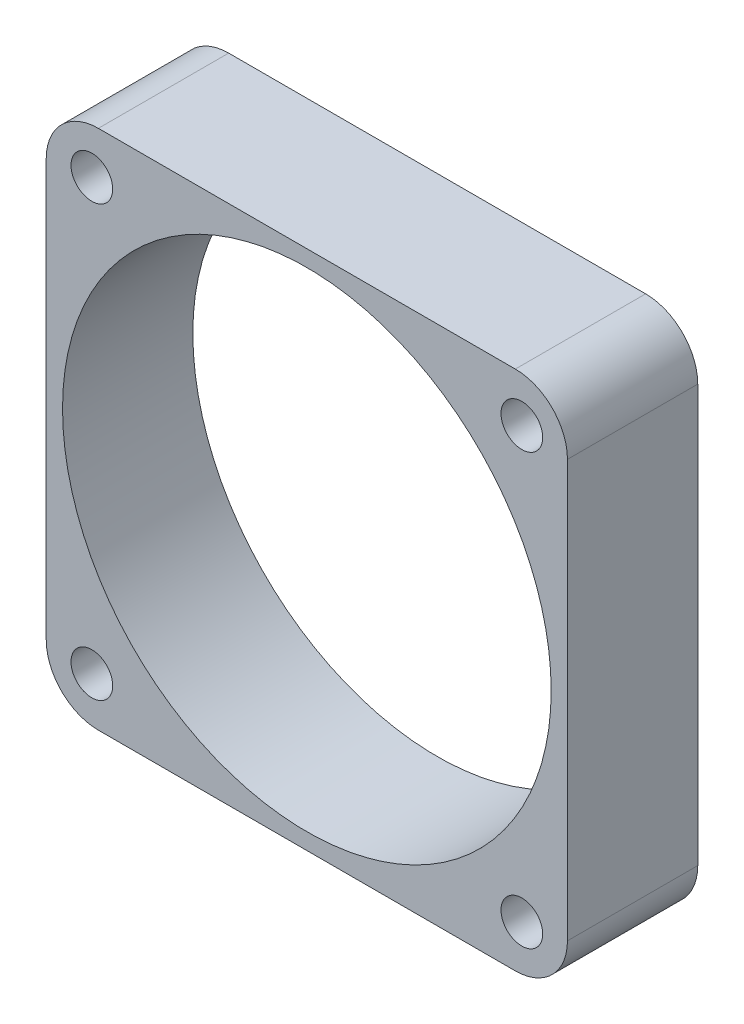
ISO-10303-21;
HEADER;
FILE_DESCRIPTION(('STEP AP214'),'2;1');
FILE_NAME('part.step','',(''),(''),'','','');
FILE_SCHEMA(('AUTOMOTIVE_DESIGN { 1 0 10303 214 1 1 1 1 }'));
ENDSEC;
DATA;
#1=APPLICATION_CONTEXT('core data for automotive mechanical design processes');
#2=APPLICATION_PROTOCOL_DEFINITION('international standard','automotive_design',2000,#1);
#3=PRODUCT_CONTEXT('',#1,'mechanical');
#4=PRODUCT('Part','Part','',(#3));
#5=PRODUCT_RELATED_PRODUCT_CATEGORY('part','',(#4));
#6=PRODUCT_DEFINITION_FORMATION('','',#4);
#7=PRODUCT_DEFINITION_CONTEXT('part definition',#1,'design');
#8=PRODUCT_DEFINITION('design','',#6,#7);
#9=PRODUCT_DEFINITION_SHAPE('','',#8);
#10=(LENGTH_UNIT() NAMED_UNIT(*) SI_UNIT(.MILLI.,.METRE.));
#11=(NAMED_UNIT(*) PLANE_ANGLE_UNIT() SI_UNIT($,.RADIAN.));
#12=(NAMED_UNIT(*) SI_UNIT($,.STERADIAN.) SOLID_ANGLE_UNIT());
#13=UNCERTAINTY_MEASURE_WITH_UNIT(LENGTH_MEASURE(1.E-05),#10,'distance_accuracy_value','');
#14=(GEOMETRIC_REPRESENTATION_CONTEXT(3) GLOBAL_UNCERTAINTY_ASSIGNED_CONTEXT((#13)) GLOBAL_UNIT_ASSIGNED_CONTEXT((#10,
#11,#12)) REPRESENTATION_CONTEXT('',''));
#15=CARTESIAN_POINT('',(0.,0.,0.));
#16=DIRECTION('',(0.,0.,1.));
#17=DIRECTION('',(1.,0.,0.));
#18=AXIS2_PLACEMENT_3D('',#15,#16,#17);
#19=CARTESIAN_POINT('',(4.,4.,10.));
#20=DIRECTION('',(0.,0.,1.));
#21=DIRECTION('',(1.,0.,0.));
#22=AXIS2_PLACEMENT_3D('',#19,#20,#21);
#23=PLANE('',#22);
#24=CARTESIAN_POINT('',(3.5,3.5,10.));
#25=DIRECTION('',(0.,0.,1.));
#26=DIRECTION('',(1.,0.,0.));
#27=AXIS2_PLACEMENT_3D('',#24,#25,#26);
#28=CIRCLE('',#27,1.6);
#29=CARTESIAN_POINT('',(5.1,3.5,10.));
#30=VERTEX_POINT('',#29);
#31=EDGE_CURVE('E197',#30,#30,#28,.T.);
#32=ORIENTED_EDGE('',*,*,#31,.F.);
#33=EDGE_LOOP('',(#32));
#34=FACE_BOUND('',#33,.T.);
#35=CARTESIAN_POINT('',(36.5,36.5,10.));
#36=DIRECTION('',(0.,0.,1.));
#37=DIRECTION('',(1.,0.,0.));
#38=AXIS2_PLACEMENT_3D('',#35,#36,#37);
#39=CIRCLE('',#38,1.6);
#40=CARTESIAN_POINT('',(38.1,36.5,10.));
#41=VERTEX_POINT('',#40);
#42=EDGE_CURVE('E185',#41,#41,#39,.T.);
#43=ORIENTED_EDGE('',*,*,#42,.F.);
#44=EDGE_LOOP('',(#43));
#45=FACE_BOUND('',#44,.T.);
#46=CARTESIAN_POINT('',(4.,4.,10.));
#47=DIRECTION('',(0.,0.,1.));
#48=DIRECTION('',(1.,0.,0.));
#49=AXIS2_PLACEMENT_3D('',#46,#47,#48);
#50=CIRCLE('',#49,4.);
#51=CARTESIAN_POINT('',(0.,4.00000000000003,10.));
#52=VERTEX_POINT('',#51);
#53=CARTESIAN_POINT('',(4.00000000000003,0.,10.));
#54=VERTEX_POINT('',#53);
#55=EDGE_CURVE('E148',#52,#54,#50,.T.);
#56=ORIENTED_EDGE('',*,*,#55,.T.);
#57=DIRECTION('',(1.,0.,0.));
#58=VECTOR('',#57,1.);
#59=CARTESIAN_POINT('',(4.00000000000003,0.,10.));
#60=LINE('',#59,#58);
#61=CARTESIAN_POINT('',(36.,0.,10.));
#62=VERTEX_POINT('',#61);
#63=EDGE_CURVE('E96',#54,#62,#60,.T.);
#64=ORIENTED_EDGE('',*,*,#63,.T.);
#65=CARTESIAN_POINT('',(36.,4.,10.));
#66=DIRECTION('',(0.,0.,1.));
#67=DIRECTION('',(1.,0.,0.));
#68=AXIS2_PLACEMENT_3D('',#65,#66,#67);
#69=CIRCLE('',#68,4.);
#70=CARTESIAN_POINT('',(40.,4.00000000000003,10.));
#71=VERTEX_POINT('',#70);
#72=EDGE_CURVE('E163',#62,#71,#69,.T.);
#73=ORIENTED_EDGE('',*,*,#72,.T.);
#74=DIRECTION('',(0.,1.,0.));
#75=VECTOR('',#74,1.);
#76=CARTESIAN_POINT('',(40.,4.00000000000003,10.));
#77=LINE('',#76,#75);
#78=CARTESIAN_POINT('',(40.,36.,10.));
#79=VERTEX_POINT('',#78);
#80=EDGE_CURVE('E176',#71,#79,#77,.T.);
#81=ORIENTED_EDGE('',*,*,#80,.T.);
#82=CARTESIAN_POINT('',(36.,36.,10.));
#83=DIRECTION('',(0.,0.,1.));
#84=DIRECTION('',(1.,0.,0.));
#85=AXIS2_PLACEMENT_3D('',#82,#83,#84);
#86=CIRCLE('',#85,4.);
#87=CARTESIAN_POINT('',(36.,40.,10.));
#88=VERTEX_POINT('',#87);
#89=EDGE_CURVE('E115',#79,#88,#86,.T.);
#90=ORIENTED_EDGE('',*,*,#89,.T.);
#91=DIRECTION('',(-1.,0.,0.));
#92=VECTOR('',#91,1.);
#93=CARTESIAN_POINT('',(4.00000000000003,40.,10.));
#94=LINE('',#93,#92);
#95=CARTESIAN_POINT('',(4.00000000000003,40.,10.));
#96=VERTEX_POINT('',#95);
#97=EDGE_CURVE('E109',#88,#96,#94,.T.);
#98=ORIENTED_EDGE('',*,*,#97,.T.);
#99=CARTESIAN_POINT('',(4.,36.,10.));
#100=DIRECTION('',(0.,0.,1.));
#101=DIRECTION('',(1.,0.,0.));
#102=AXIS2_PLACEMENT_3D('',#99,#100,#101);
#103=CIRCLE('',#102,4.);
#104=CARTESIAN_POINT('',(0.,36.,10.));
#105=VERTEX_POINT('',#104);
#106=EDGE_CURVE('E113',#96,#105,#103,.T.);
#107=ORIENTED_EDGE('',*,*,#106,.T.);
#108=DIRECTION('',(0.,-1.,0.));
#109=VECTOR('',#108,1.);
#110=CARTESIAN_POINT('',(0.,4.00000000000003,10.));
#111=LINE('',#110,#109);
#112=EDGE_CURVE('E53',#105,#52,#111,.T.);
#113=ORIENTED_EDGE('',*,*,#112,.T.);
#114=EDGE_LOOP('',(#56,#64,#73,#81,#90,#98,#107,#113));
#115=FACE_BOUND('',#114,.T.);
#116=CARTESIAN_POINT('',(3.49999999999999,36.5,10.));
#117=DIRECTION('',(0.,0.,1.));
#118=DIRECTION('',(1.,0.,0.));
#119=AXIS2_PLACEMENT_3D('',#116,#117,#118);
#120=CIRCLE('',#119,1.6);
#121=CARTESIAN_POINT('',(5.09999999999999,36.5,10.));
#122=VERTEX_POINT('',#121);
#123=EDGE_CURVE('E137',#122,#122,#120,.T.);
#124=ORIENTED_EDGE('',*,*,#123,.F.);
#125=EDGE_LOOP('',(#124));
#126=FACE_BOUND('',#125,.T.);
#127=CARTESIAN_POINT('',(36.5,3.5,10.));
#128=DIRECTION('',(0.,0.,1.));
#129=DIRECTION('',(1.,0.,0.));
#130=AXIS2_PLACEMENT_3D('',#127,#128,#129);
#131=CIRCLE('',#130,1.6);
#132=CARTESIAN_POINT('',(38.1,3.5,10.));
#133=VERTEX_POINT('',#132);
#134=EDGE_CURVE('E191',#133,#133,#131,.T.);
#135=ORIENTED_EDGE('',*,*,#134,.F.);
#136=EDGE_LOOP('',(#135));
#137=FACE_BOUND('',#136,.T.);
#138=CARTESIAN_POINT('',(20.,20.,10.));
#139=DIRECTION('',(0.,0.,1.));
#140=DIRECTION('',(1.,0.,0.));
#141=AXIS2_PLACEMENT_3D('',#138,#139,#140);
#142=CIRCLE('',#141,18.75);
#143=CARTESIAN_POINT('',(38.75,20.,10.));
#144=VERTEX_POINT('',#143);
#145=EDGE_CURVE('E203',#144,#144,#142,.T.);
#146=ORIENTED_EDGE('',*,*,#145,.F.);
#147=EDGE_LOOP('',(#146));
#148=FACE_BOUND('',#147,.T.);
#149=ADVANCED_FACE('F36',(#34,#45,#115,#126,#137,#148),#23,.T.);
#150=CARTESIAN_POINT('',(4.,4.,0.));
#151=DIRECTION('',(0.,0.,1.));
#152=DIRECTION('',(1.,0.,0.));
#153=AXIS2_PLACEMENT_3D('',#150,#151,#152);
#154=PLANE('',#153);
#155=CARTESIAN_POINT('',(4.,4.,0.));
#156=DIRECTION('',(0.,0.,1.));
#157=DIRECTION('',(1.,0.,0.));
#158=AXIS2_PLACEMENT_3D('',#155,#156,#157);
#159=CIRCLE('',#158,4.);
#160=CARTESIAN_POINT('',(0.,4.00000000000003,0.));
#161=VERTEX_POINT('',#160);
#162=CARTESIAN_POINT('',(4.00000000000003,0.,0.));
#163=VERTEX_POINT('',#162);
#164=EDGE_CURVE('E133',#161,#163,#159,.T.);
#165=ORIENTED_EDGE('',*,*,#164,.F.);
#166=DIRECTION('',(0.,-1.,0.));
#167=VECTOR('',#166,1.);
#168=CARTESIAN_POINT('',(0.,4.00000000000003,0.));
#169=LINE('',#168,#167);
#170=CARTESIAN_POINT('',(0.,36.,0.));
#171=VERTEX_POINT('',#170);
#172=EDGE_CURVE('E88',#171,#161,#169,.T.);
#173=ORIENTED_EDGE('',*,*,#172,.F.);
#174=CARTESIAN_POINT('',(4.,36.,0.));
#175=DIRECTION('',(0.,0.,1.));
#176=DIRECTION('',(1.,0.,0.));
#177=AXIS2_PLACEMENT_3D('',#174,#175,#176);
#178=CIRCLE('',#177,4.);
#179=CARTESIAN_POINT('',(4.00000000000003,40.,0.));
#180=VERTEX_POINT('',#179);
#181=EDGE_CURVE('E82',#180,#171,#178,.T.);
#182=ORIENTED_EDGE('',*,*,#181,.F.);
#183=DIRECTION('',(-1.,0.,0.));
#184=VECTOR('',#183,1.);
#185=CARTESIAN_POINT('',(4.00000000000003,40.,0.));
#186=LINE('',#185,#184);
#187=CARTESIAN_POINT('',(36.,40.,0.));
#188=VERTEX_POINT('',#187);
#189=EDGE_CURVE('E123',#188,#180,#186,.T.);
#190=ORIENTED_EDGE('',*,*,#189,.F.);
#191=CARTESIAN_POINT('',(36.,36.,0.));
#192=DIRECTION('',(0.,0.,1.));
#193=DIRECTION('',(1.,0.,0.));
#194=AXIS2_PLACEMENT_3D('',#191,#192,#193);
#195=CIRCLE('',#194,4.);
#196=CARTESIAN_POINT('',(40.,36.,0.));
#197=VERTEX_POINT('',#196);
#198=EDGE_CURVE('E143',#197,#188,#195,.T.);
#199=ORIENTED_EDGE('',*,*,#198,.F.);
#200=DIRECTION('',(0.,1.,0.));
#201=VECTOR('',#200,1.);
#202=CARTESIAN_POINT('',(40.,4.00000000000003,0.));
#203=LINE('',#202,#201);
#204=CARTESIAN_POINT('',(40.,4.00000000000003,0.));
#205=VERTEX_POINT('',#204);
#206=EDGE_CURVE('E141',#205,#197,#203,.T.);
#207=ORIENTED_EDGE('',*,*,#206,.F.);
#208=CARTESIAN_POINT('',(36.,4.,0.));
#209=DIRECTION('',(0.,0.,1.));
#210=DIRECTION('',(1.,0.,0.));
#211=AXIS2_PLACEMENT_3D('',#208,#209,#210);
#212=CIRCLE('',#211,4.);
#213=CARTESIAN_POINT('',(36.,0.,0.));
#214=VERTEX_POINT('',#213);
#215=EDGE_CURVE('E139',#214,#205,#212,.T.);
#216=ORIENTED_EDGE('',*,*,#215,.F.);
#217=DIRECTION('',(1.,0.,0.));
#218=VECTOR('',#217,1.);
#219=CARTESIAN_POINT('',(4.00000000000003,0.,0.));
#220=LINE('',#219,#218);
#221=EDGE_CURVE('E136',#163,#214,#220,.T.);
#222=ORIENTED_EDGE('',*,*,#221,.F.);
#223=EDGE_LOOP('',(#165,#173,#182,#190,#199,#207,#216,#222));
#224=FACE_BOUND('',#223,.T.);
#225=CARTESIAN_POINT('',(3.49999999999999,36.5,0.));
#226=DIRECTION('',(0.,0.,1.));
#227=DIRECTION('',(1.,0.,0.));
#228=AXIS2_PLACEMENT_3D('',#225,#226,#227);
#229=CIRCLE('',#228,1.6);
#230=CARTESIAN_POINT('',(5.09999999999999,36.5,0.));
#231=VERTEX_POINT('',#230);
#232=EDGE_CURVE('E182',#231,#231,#229,.T.);
#233=ORIENTED_EDGE('',*,*,#232,.T.);
#234=EDGE_LOOP('',(#233));
#235=FACE_BOUND('',#234,.T.);
#236=CARTESIAN_POINT('',(36.5,36.5,0.));
#237=DIRECTION('',(0.,0.,1.));
#238=DIRECTION('',(1.,0.,0.));
#239=AXIS2_PLACEMENT_3D('',#236,#237,#238);
#240=CIRCLE('',#239,1.6);
#241=CARTESIAN_POINT('',(38.1,36.5,0.));
#242=VERTEX_POINT('',#241);
#243=EDGE_CURVE('E188',#242,#242,#240,.T.);
#244=ORIENTED_EDGE('',*,*,#243,.T.);
#245=EDGE_LOOP('',(#244));
#246=FACE_BOUND('',#245,.T.);
#247=CARTESIAN_POINT('',(36.5,3.5,0.));
#248=DIRECTION('',(0.,0.,1.));
#249=DIRECTION('',(1.,0.,0.));
#250=AXIS2_PLACEMENT_3D('',#247,#248,#249);
#251=CIRCLE('',#250,1.6);
#252=CARTESIAN_POINT('',(38.1,3.5,0.));
#253=VERTEX_POINT('',#252);
#254=EDGE_CURVE('E194',#253,#253,#251,.T.);
#255=ORIENTED_EDGE('',*,*,#254,.T.);
#256=EDGE_LOOP('',(#255));
#257=FACE_BOUND('',#256,.T.);
#258=CARTESIAN_POINT('',(3.5,3.5,0.));
#259=DIRECTION('',(0.,0.,1.));
#260=DIRECTION('',(1.,0.,0.));
#261=AXIS2_PLACEMENT_3D('',#258,#259,#260);
#262=CIRCLE('',#261,1.6);
#263=CARTESIAN_POINT('',(5.1,3.5,0.));
#264=VERTEX_POINT('',#263);
#265=EDGE_CURVE('E200',#264,#264,#262,.T.);
#266=ORIENTED_EDGE('',*,*,#265,.T.);
#267=EDGE_LOOP('',(#266));
#268=FACE_BOUND('',#267,.T.);
#269=CARTESIAN_POINT('',(20.,20.,0.));
#270=DIRECTION('',(0.,0.,1.));
#271=DIRECTION('',(1.,0.,0.));
#272=AXIS2_PLACEMENT_3D('',#269,#270,#271);
#273=CIRCLE('',#272,18.75);
#274=CARTESIAN_POINT('',(38.75,20.,0.));
#275=VERTEX_POINT('',#274);
#276=EDGE_CURVE('E206',#275,#275,#273,.T.);
#277=ORIENTED_EDGE('',*,*,#276,.T.);
#278=EDGE_LOOP('',(#277));
#279=FACE_BOUND('',#278,.T.);
#280=ADVANCED_FACE('F167',(#224,#235,#246,#257,#268,#279),#154,.F.);
#281=CARTESIAN_POINT('',(4.,4.,10.));
#282=DIRECTION('',(0.,0.,-1.));
#283=DIRECTION('',(-1.,0.,0.));
#284=AXIS2_PLACEMENT_3D('',#281,#282,#283);
#285=CYLINDRICAL_SURFACE('',#284,4.);
#286=ORIENTED_EDGE('',*,*,#164,.T.);
#287=DIRECTION('',(0.,0.,-1.));
#288=VECTOR('',#287,1.);
#289=CARTESIAN_POINT('',(4.00000000000003,0.,10.));
#290=LINE('',#289,#288);
#291=EDGE_CURVE('E11',#54,#163,#290,.T.);
#292=ORIENTED_EDGE('',*,*,#291,.F.);
#293=ORIENTED_EDGE('',*,*,#55,.F.);
#294=DIRECTION('',(0.,0.,-1.));
#295=VECTOR('',#294,1.);
#296=CARTESIAN_POINT('',(0.,4.00000000000003,10.));
#297=LINE('',#296,#295);
#298=EDGE_CURVE('E129',#52,#161,#297,.T.);
#299=ORIENTED_EDGE('',*,*,#298,.T.);
#300=EDGE_LOOP('',(#286,#292,#293,#299));
#301=FACE_BOUND('',#300,.T.);
#302=ADVANCED_FACE('F38',(#301),#285,.T.);
#303=CARTESIAN_POINT('',(4.00000000000003,0.,10.));
#304=DIRECTION('',(0.,1.,0.));
#305=DIRECTION('',(0.,0.,1.));
#306=AXIS2_PLACEMENT_3D('',#303,#304,#305);
#307=PLANE('',#306);
#308=ORIENTED_EDGE('',*,*,#221,.T.);
#309=DIRECTION('',(0.,0.,-1.));
#310=VECTOR('',#309,1.);
#311=CARTESIAN_POINT('',(36.,0.,10.));
#312=LINE('',#311,#310);
#313=EDGE_CURVE('E45',#62,#214,#312,.T.);
#314=ORIENTED_EDGE('',*,*,#313,.F.);
#315=ORIENTED_EDGE('',*,*,#63,.F.);
#316=ORIENTED_EDGE('',*,*,#291,.T.);
#317=EDGE_LOOP('',(#308,#314,#315,#316));
#318=FACE_BOUND('',#317,.T.);
#319=ADVANCED_FACE('F240',(#318),#307,.F.);
#320=CARTESIAN_POINT('',(36.,4.,10.));
#321=DIRECTION('',(0.,0.,-1.));
#322=DIRECTION('',(-1.,0.,0.));
#323=AXIS2_PLACEMENT_3D('',#320,#321,#322);
#324=CYLINDRICAL_SURFACE('',#323,4.);
#325=ORIENTED_EDGE('',*,*,#215,.T.);
#326=DIRECTION('',(0.,0.,-1.));
#327=VECTOR('',#326,1.);
#328=CARTESIAN_POINT('',(40.,4.00000000000003,10.));
#329=LINE('',#328,#327);
#330=EDGE_CURVE('E155',#71,#205,#329,.T.);
#331=ORIENTED_EDGE('',*,*,#330,.F.);
#332=ORIENTED_EDGE('',*,*,#72,.F.);
#333=ORIENTED_EDGE('',*,*,#313,.T.);
#334=EDGE_LOOP('',(#325,#331,#332,#333));
#335=FACE_BOUND('',#334,.T.);
#336=ADVANCED_FACE('F161',(#335),#324,.T.);
#337=CARTESIAN_POINT('',(40.,4.00000000000003,10.));
#338=DIRECTION('',(-1.,0.,0.));
#339=DIRECTION('',(0.,-1.,0.));
#340=AXIS2_PLACEMENT_3D('',#337,#338,#339);
#341=PLANE('',#340);
#342=ORIENTED_EDGE('',*,*,#206,.T.);
#343=DIRECTION('',(0.,0.,-1.));
#344=VECTOR('',#343,1.);
#345=CARTESIAN_POINT('',(40.,36.,10.));
#346=LINE('',#345,#344);
#347=EDGE_CURVE('E152',#79,#197,#346,.T.);
#348=ORIENTED_EDGE('',*,*,#347,.F.);
#349=ORIENTED_EDGE('',*,*,#80,.F.);
#350=ORIENTED_EDGE('',*,*,#330,.T.);
#351=EDGE_LOOP('',(#342,#348,#349,#350));
#352=FACE_BOUND('',#351,.T.);
#353=ADVANCED_FACE('F172',(#352),#341,.F.);
#354=CARTESIAN_POINT('',(36.,36.,10.));
#355=DIRECTION('',(0.,0.,-1.));
#356=DIRECTION('',(-1.,0.,0.));
#357=AXIS2_PLACEMENT_3D('',#354,#355,#356);
#358=CYLINDRICAL_SURFACE('',#357,4.);
#359=ORIENTED_EDGE('',*,*,#198,.T.);
#360=DIRECTION('',(0.,0.,-1.));
#361=VECTOR('',#360,1.);
#362=CARTESIAN_POINT('',(36.,40.,10.));
#363=LINE('',#362,#361);
#364=EDGE_CURVE('E124',#88,#188,#363,.T.);
#365=ORIENTED_EDGE('',*,*,#364,.F.);
#366=ORIENTED_EDGE('',*,*,#89,.F.);
#367=ORIENTED_EDGE('',*,*,#347,.T.);
#368=EDGE_LOOP('',(#359,#365,#366,#367));
#369=FACE_BOUND('',#368,.T.);
#370=ADVANCED_FACE('F175',(#369),#358,.T.);
#371=CARTESIAN_POINT('',(4.00000000000003,40.,10.));
#372=DIRECTION('',(0.,-1.,0.));
#373=DIRECTION('',(0.,0.,-1.));
#374=AXIS2_PLACEMENT_3D('',#371,#372,#373);
#375=PLANE('',#374);
#376=ORIENTED_EDGE('',*,*,#189,.T.);
#377=DIRECTION('',(0.,0.,-1.));
#378=VECTOR('',#377,1.);
#379=CARTESIAN_POINT('',(4.00000000000003,40.,10.));
#380=LINE('',#379,#378);
#381=EDGE_CURVE('E120',#96,#180,#380,.T.);
#382=ORIENTED_EDGE('',*,*,#381,.F.);
#383=ORIENTED_EDGE('',*,*,#97,.F.);
#384=ORIENTED_EDGE('',*,*,#364,.T.);
#385=EDGE_LOOP('',(#376,#382,#383,#384));
#386=FACE_BOUND('',#385,.T.);
#387=ADVANCED_FACE('F121',(#386),#375,.F.);
#388=CARTESIAN_POINT('',(4.,36.,10.));
#389=DIRECTION('',(0.,0.,-1.));
#390=DIRECTION('',(-1.,0.,0.));
#391=AXIS2_PLACEMENT_3D('',#388,#389,#390);
#392=CYLINDRICAL_SURFACE('',#391,4.);
#393=ORIENTED_EDGE('',*,*,#181,.T.);
#394=DIRECTION('',(0.,0.,-1.));
#395=VECTOR('',#394,1.);
#396=CARTESIAN_POINT('',(0.,36.,10.));
#397=LINE('',#396,#395);
#398=EDGE_CURVE('E125',#105,#171,#397,.T.);
#399=ORIENTED_EDGE('',*,*,#398,.F.);
#400=ORIENTED_EDGE('',*,*,#106,.F.);
#401=ORIENTED_EDGE('',*,*,#381,.T.);
#402=EDGE_LOOP('',(#393,#399,#400,#401));
#403=FACE_BOUND('',#402,.T.);
#404=ADVANCED_FACE('F127',(#403),#392,.T.);
#405=CARTESIAN_POINT('',(0.,4.00000000000003,10.));
#406=DIRECTION('',(1.,0.,0.));
#407=DIRECTION('',(0.,0.,-1.));
#408=AXIS2_PLACEMENT_3D('',#405,#406,#407);
#409=PLANE('',#408);
#410=ORIENTED_EDGE('',*,*,#172,.T.);
#411=ORIENTED_EDGE('',*,*,#298,.F.);
#412=ORIENTED_EDGE('',*,*,#112,.F.);
#413=ORIENTED_EDGE('',*,*,#398,.T.);
#414=EDGE_LOOP('',(#410,#411,#412,#413));
#415=FACE_BOUND('',#414,.T.);
#416=ADVANCED_FACE('F228',(#415),#409,.F.);
#417=CARTESIAN_POINT('',(3.49999999999999,36.5,10.));
#418=DIRECTION('',(0.,0.,-1.));
#419=DIRECTION('',(-1.,0.,0.));
#420=AXIS2_PLACEMENT_3D('',#417,#418,#419);
#421=CYLINDRICAL_SURFACE('',#420,1.6);
#422=ORIENTED_EDGE('',*,*,#123,.T.);
#423=EDGE_LOOP('',(#422));
#424=FACE_BOUND('',#423,.T.);
#425=ORIENTED_EDGE('',*,*,#232,.F.);
#426=EDGE_LOOP('',(#425));
#427=FACE_BOUND('',#426,.T.);
#428=ADVANCED_FACE('F225',(#424,#427),#421,.F.);
#429=CARTESIAN_POINT('',(36.5,36.5,10.));
#430=DIRECTION('',(0.,0.,-1.));
#431=DIRECTION('',(-1.,0.,0.));
#432=AXIS2_PLACEMENT_3D('',#429,#430,#431);
#433=CYLINDRICAL_SURFACE('',#432,1.6);
#434=ORIENTED_EDGE('',*,*,#42,.T.);
#435=EDGE_LOOP('',(#434));
#436=FACE_BOUND('',#435,.T.);
#437=ORIENTED_EDGE('',*,*,#243,.F.);
#438=EDGE_LOOP('',(#437));
#439=FACE_BOUND('',#438,.T.);
#440=ADVANCED_FACE('F304',(#436,#439),#433,.F.);
#441=CARTESIAN_POINT('',(36.5,3.5,10.));
#442=DIRECTION('',(0.,0.,-1.));
#443=DIRECTION('',(-1.,0.,0.));
#444=AXIS2_PLACEMENT_3D('',#441,#442,#443);
#445=CYLINDRICAL_SURFACE('',#444,1.6);
#446=ORIENTED_EDGE('',*,*,#134,.T.);
#447=EDGE_LOOP('',(#446));
#448=FACE_BOUND('',#447,.T.);
#449=ORIENTED_EDGE('',*,*,#254,.F.);
#450=EDGE_LOOP('',(#449));
#451=FACE_BOUND('',#450,.T.);
#452=ADVANCED_FACE('F312',(#448,#451),#445,.F.);
#453=CARTESIAN_POINT('',(3.5,3.5,10.));
#454=DIRECTION('',(0.,0.,-1.));
#455=DIRECTION('',(-1.,0.,0.));
#456=AXIS2_PLACEMENT_3D('',#453,#454,#455);
#457=CYLINDRICAL_SURFACE('',#456,1.6);
#458=ORIENTED_EDGE('',*,*,#31,.T.);
#459=EDGE_LOOP('',(#458));
#460=FACE_BOUND('',#459,.T.);
#461=ORIENTED_EDGE('',*,*,#265,.F.);
#462=EDGE_LOOP('',(#461));
#463=FACE_BOUND('',#462,.T.);
#464=ADVANCED_FACE('F320',(#460,#463),#457,.F.);
#465=CARTESIAN_POINT('',(20.,20.,10.));
#466=DIRECTION('',(0.,0.,-1.));
#467=DIRECTION('',(-1.,0.,0.));
#468=AXIS2_PLACEMENT_3D('',#465,#466,#467);
#469=CYLINDRICAL_SURFACE('',#468,18.75);
#470=ORIENTED_EDGE('',*,*,#145,.T.);
#471=EDGE_LOOP('',(#470));
#472=FACE_BOUND('',#471,.T.);
#473=ORIENTED_EDGE('',*,*,#276,.F.);
#474=EDGE_LOOP('',(#473));
#475=FACE_BOUND('',#474,.T.);
#476=ADVANCED_FACE('F212',(#472,#475),#469,.F.);
#477=CLOSED_SHELL('',(#149,#280,#302,#319,#336,#353,#370,#387,#404,#416,#428,#440,#452,#464,#476));
#478=MANIFOLD_SOLID_BREP('B2',#477);
#479=ADVANCED_BREP_SHAPE_REPRESENTATION('',(#18,#478),#14);
#480=SHAPE_DEFINITION_REPRESENTATION(#9,#479);
ENDSEC;
END-ISO-10303-21;
